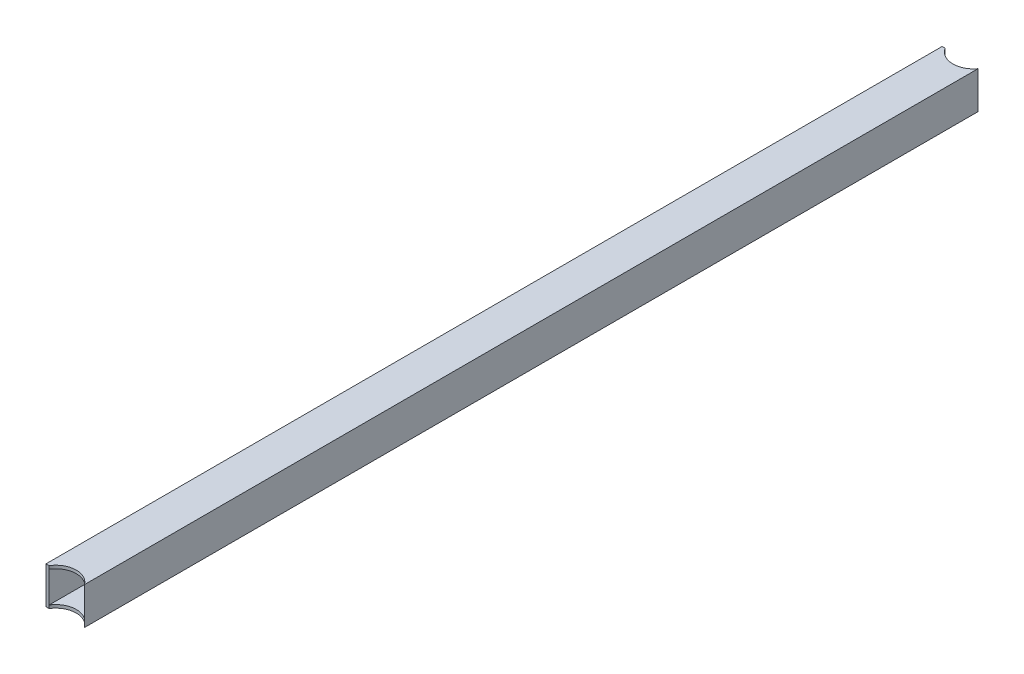
ISO-10303-21;
HEADER;
FILE_DESCRIPTION(('STEP AP214'),'2;1');
FILE_NAME('part.step','',(''),(''),'','','');
FILE_SCHEMA(('AUTOMOTIVE_DESIGN { 1 0 10303 214 1 1 1 1 }'));
ENDSEC;
DATA;
#1=APPLICATION_CONTEXT('core data for automotive mechanical design processes');
#2=APPLICATION_PROTOCOL_DEFINITION('international standard','automotive_design',2000,#1);
#3=PRODUCT_CONTEXT('',#1,'mechanical');
#4=PRODUCT('Part','Part','',(#3));
#5=PRODUCT_RELATED_PRODUCT_CATEGORY('part','',(#4));
#6=PRODUCT_DEFINITION_FORMATION('','',#4);
#7=PRODUCT_DEFINITION_CONTEXT('part definition',#1,'design');
#8=PRODUCT_DEFINITION('design','',#6,#7);
#9=PRODUCT_DEFINITION_SHAPE('','',#8);
#10=(LENGTH_UNIT() NAMED_UNIT(*) SI_UNIT(.MILLI.,.METRE.));
#11=(NAMED_UNIT(*) PLANE_ANGLE_UNIT() SI_UNIT($,.RADIAN.));
#12=(NAMED_UNIT(*) SI_UNIT($,.STERADIAN.) SOLID_ANGLE_UNIT());
#13=UNCERTAINTY_MEASURE_WITH_UNIT(LENGTH_MEASURE(1.E-05),#10,'distance_accuracy_value','');
#14=(GEOMETRIC_REPRESENTATION_CONTEXT(3) GLOBAL_UNCERTAINTY_ASSIGNED_CONTEXT((#13)) GLOBAL_UNIT_ASSIGNED_CONTEXT((#10,
#11,#12)) REPRESENTATION_CONTEXT('',''));
#15=CARTESIAN_POINT('',(0.,0.,0.));
#16=DIRECTION('',(0.,0.,1.));
#17=DIRECTION('',(1.,0.,0.));
#18=AXIS2_PLACEMENT_3D('',#15,#16,#17);
#19=CARTESIAN_POINT('',(21.0820000000001,0.,469.9));
#20=DIRECTION('',(0.,1.,0.));
#21=DIRECTION('',(0.,0.,1.));
#22=AXIS2_PLACEMENT_3D('',#19,#20,#21);
#23=CYLINDRICAL_SURFACE('',#22,21.082);
#24=DIRECTION('',(0.,1.,0.));
#25=VECTOR('',#24,1.);
#26=CARTESIAN_POINT('',(3.17500000000001,0.,458.773901177861));
#27=LINE('',#26,#25);
#28=CARTESIAN_POINT('',(3.17500000000001,3.175,458.773901177861));
#29=VERTEX_POINT('',#28);
#30=CARTESIAN_POINT('',(3.17500000000001,34.925,458.773901177861));
#31=VERTEX_POINT('',#30);
#32=EDGE_CURVE('E150',#29,#31,#27,.T.);
#33=ORIENTED_EDGE('',*,*,#32,.T.);
#34=CARTESIAN_POINT('',(21.0820000000001,34.925,469.9));
#35=DIRECTION('',(0.,-1.,0.));
#36=DIRECTION('',(0.,0.,-1.));
#37=AXIS2_PLACEMENT_3D('',#34,#35,#36);
#38=CIRCLE('',#37,21.082);
#39=CARTESIAN_POINT('',(34.925,34.925,453.999620287553));
#40=VERTEX_POINT('',#39);
#41=EDGE_CURVE('E11',#31,#40,#38,.T.);
#42=ORIENTED_EDGE('',*,*,#41,.T.);
#43=DIRECTION('',(0.,1.,0.));
#44=VECTOR('',#43,1.);
#45=CARTESIAN_POINT('',(34.925,0.,453.999620287553));
#46=LINE('',#45,#44);
#47=CARTESIAN_POINT('',(34.925,3.175,453.999620287553));
#48=VERTEX_POINT('',#47);
#49=EDGE_CURVE('E154',#40,#48,#46,.F.);
#50=ORIENTED_EDGE('',*,*,#49,.T.);
#51=CARTESIAN_POINT('',(21.0820000000001,3.175,469.9));
#52=DIRECTION('',(0.,1.,0.));
#53=DIRECTION('',(0.,0.,1.));
#54=AXIS2_PLACEMENT_3D('',#51,#52,#53);
#55=CIRCLE('',#54,21.082);
#56=EDGE_CURVE('E152',#48,#29,#55,.T.);
#57=ORIENTED_EDGE('',*,*,#56,.T.);
#58=EDGE_LOOP('',(#33,#42,#50,#57));
#59=FACE_BOUND('',#58,.T.);
#60=DIRECTION('',(0.,1.,0.));
#61=VECTOR('',#60,1.);
#62=CARTESIAN_POINT('',(3.16655784106913,0.,458.7875));
#63=LINE('',#62,#61);
#64=CARTESIAN_POINT('',(3.16655784106913,0.,458.7875));
#65=VERTEX_POINT('',#64);
#66=CARTESIAN_POINT('',(3.16655784106913,38.1,458.7875));
#67=VERTEX_POINT('',#66);
#68=EDGE_CURVE('E114',#65,#67,#63,.T.);
#69=ORIENTED_EDGE('',*,*,#68,.F.);
#70=CARTESIAN_POINT('',(21.0820000000001,0.,469.9));
#71=DIRECTION('',(0.,1.,0.));
#72=DIRECTION('',(0.,0.,1.));
#73=AXIS2_PLACEMENT_3D('',#70,#71,#72);
#74=CIRCLE('',#73,21.082);
#75=CARTESIAN_POINT('',(38.1,0.,457.456592106661));
#76=VERTEX_POINT('',#75);
#77=EDGE_CURVE('E122',#76,#65,#74,.T.);
#78=ORIENTED_EDGE('',*,*,#77,.F.);
#79=DIRECTION('',(0.,1.,0.));
#80=VECTOR('',#79,1.);
#81=CARTESIAN_POINT('',(38.1,0.,457.456592106661));
#82=LINE('',#81,#80);
#83=CARTESIAN_POINT('',(38.1,38.1,457.456592106661));
#84=VERTEX_POINT('',#83);
#85=EDGE_CURVE('E147',#84,#76,#82,.F.);
#86=ORIENTED_EDGE('',*,*,#85,.F.);
#87=CARTESIAN_POINT('',(21.0820000000001,38.1,469.9));
#88=DIRECTION('',(0.,1.,0.));
#89=DIRECTION('',(0.,0.,1.));
#90=AXIS2_PLACEMENT_3D('',#87,#88,#89);
#91=CIRCLE('',#90,21.082);
#92=EDGE_CURVE('E169',#84,#67,#91,.T.);
#93=ORIENTED_EDGE('',*,*,#92,.T.);
#94=EDGE_LOOP('',(#69,#78,#86,#93));
#95=FACE_BOUND('',#94,.T.);
#96=ADVANCED_FACE('F32',(#59,#95),#23,.F.);
#97=CARTESIAN_POINT('',(0.,38.1,1270.));
#98=DIRECTION('',(0.,-1.,0.));
#99=DIRECTION('',(0.,0.,-1.));
#100=AXIS2_PLACEMENT_3D('',#97,#98,#99);
#101=PLANE('',#100);
#102=DIRECTION('',(1.,0.,0.));
#103=VECTOR('',#102,1.);
#104=CARTESIAN_POINT('',(0.,38.1,458.7875));
#105=LINE('',#104,#103);
#106=CARTESIAN_POINT('',(0.,38.1,458.7875));
#107=VERTEX_POINT('',#106);
#108=EDGE_CURVE('E47',#107,#67,#105,.T.);
#109=ORIENTED_EDGE('',*,*,#108,.T.);
#110=ORIENTED_EDGE('',*,*,#92,.F.);
#111=DIRECTION('',(0.,0.,-1.));
#112=VECTOR('',#111,1.);
#113=CARTESIAN_POINT('',(38.1,38.1,1270.));
#114=LINE('',#113,#112);
#115=CARTESIAN_POINT('',(38.1,38.1,-457.456592106662));
#116=VERTEX_POINT('',#115);
#117=EDGE_CURVE('E128',#84,#116,#114,.T.);
#118=ORIENTED_EDGE('',*,*,#117,.T.);
#119=CARTESIAN_POINT('',(21.0819999999996,38.1,-469.9));
#120=DIRECTION('',(0.,1.,0.));
#121=DIRECTION('',(0.,0.,-1.));
#122=AXIS2_PLACEMENT_3D('',#119,#120,#121);
#123=CIRCLE('',#122,21.0819999999999);
#124=CARTESIAN_POINT('',(3.16655784106879,38.1,-458.7875));
#125=VERTEX_POINT('',#124);
#126=EDGE_CURVE('E165',#125,#116,#123,.T.);
#127=ORIENTED_EDGE('',*,*,#126,.F.);
#128=DIRECTION('',(1.,0.,0.));
#129=VECTOR('',#128,1.);
#130=CARTESIAN_POINT('',(0.,38.1,-458.7875));
#131=LINE('',#130,#129);
#132=CARTESIAN_POINT('',(0.,38.1,-458.7875));
#133=VERTEX_POINT('',#132);
#134=EDGE_CURVE('E177',#133,#125,#131,.T.);
#135=ORIENTED_EDGE('',*,*,#134,.F.);
#136=DIRECTION('',(0.,0.,-1.));
#137=VECTOR('',#136,1.);
#138=CARTESIAN_POINT('',(0.,38.1,1270.));
#139=LINE('',#138,#137);
#140=EDGE_CURVE('E133',#107,#133,#139,.T.);
#141=ORIENTED_EDGE('',*,*,#140,.F.);
#142=EDGE_LOOP('',(#109,#110,#118,#127,#135,#141));
#143=FACE_BOUND('',#142,.T.);
#144=ADVANCED_FACE('F183',(#143),#101,.F.);
#145=CARTESIAN_POINT('',(0.,0.,1270.));
#146=DIRECTION('',(0.,1.,0.));
#147=DIRECTION('',(0.,0.,1.));
#148=AXIS2_PLACEMENT_3D('',#145,#146,#147);
#149=PLANE('',#148);
#150=DIRECTION('',(1.,0.,0.));
#151=VECTOR('',#150,1.);
#152=CARTESIAN_POINT('',(0.,0.,458.7875));
#153=LINE('',#152,#151);
#154=CARTESIAN_POINT('',(0.,0.,458.7875));
#155=VERTEX_POINT('',#154);
#156=EDGE_CURVE('E108',#155,#65,#153,.T.);
#157=ORIENTED_EDGE('',*,*,#156,.F.);
#158=DIRECTION('',(0.,0.,-1.));
#159=VECTOR('',#158,1.);
#160=CARTESIAN_POINT('',(0.,0.,1270.));
#161=LINE('',#160,#159);
#162=CARTESIAN_POINT('',(0.,0.,-458.787499999999));
#163=VERTEX_POINT('',#162);
#164=EDGE_CURVE('E120',#155,#163,#161,.T.);
#165=ORIENTED_EDGE('',*,*,#164,.T.);
#166=DIRECTION('',(1.,0.,0.));
#167=VECTOR('',#166,1.);
#168=CARTESIAN_POINT('',(0.,0.,-458.7875));
#169=LINE('',#168,#167);
#170=CARTESIAN_POINT('',(3.16655784106879,0.,-458.7875));
#171=VERTEX_POINT('',#170);
#172=EDGE_CURVE('E55',#163,#171,#169,.T.);
#173=ORIENTED_EDGE('',*,*,#172,.T.);
#174=CARTESIAN_POINT('',(21.0819999999996,0.,-469.9));
#175=DIRECTION('',(0.,1.,0.));
#176=DIRECTION('',(0.,0.,-1.));
#177=AXIS2_PLACEMENT_3D('',#174,#175,#176);
#178=CIRCLE('',#177,21.0819999999999);
#179=CARTESIAN_POINT('',(38.1,0.,-457.456592106662));
#180=VERTEX_POINT('',#179);
#181=EDGE_CURVE('E167',#171,#180,#178,.T.);
#182=ORIENTED_EDGE('',*,*,#181,.T.);
#183=DIRECTION('',(0.,0.,-1.));
#184=VECTOR('',#183,1.);
#185=CARTESIAN_POINT('',(38.1,0.,1270.));
#186=LINE('',#185,#184);
#187=EDGE_CURVE('E125',#76,#180,#186,.T.);
#188=ORIENTED_EDGE('',*,*,#187,.F.);
#189=ORIENTED_EDGE('',*,*,#77,.T.);
#190=EDGE_LOOP('',(#157,#165,#173,#182,#188,#189));
#191=FACE_BOUND('',#190,.T.);
#192=ADVANCED_FACE('F119',(#191),#149,.F.);
#193=CARTESIAN_POINT('',(0.,0.,1270.));
#194=DIRECTION('',(1.,0.,0.));
#195=DIRECTION('',(0.,0.,-1.));
#196=AXIS2_PLACEMENT_3D('',#193,#194,#195);
#197=PLANE('',#196);
#198=DIRECTION('',(0.,1.,0.));
#199=VECTOR('',#198,1.);
#200=CARTESIAN_POINT('',(0.,0.,458.7875));
#201=LINE('',#200,#199);
#202=EDGE_CURVE('E105',#155,#107,#201,.T.);
#203=ORIENTED_EDGE('',*,*,#202,.T.);
#204=ORIENTED_EDGE('',*,*,#140,.T.);
#205=DIRECTION('',(0.,1.,0.));
#206=VECTOR('',#205,1.);
#207=CARTESIAN_POINT('',(0.,0.,-458.7875));
#208=LINE('',#207,#206);
#209=EDGE_CURVE('E124',#163,#133,#208,.T.);
#210=ORIENTED_EDGE('',*,*,#209,.F.);
#211=ORIENTED_EDGE('',*,*,#164,.F.);
#212=EDGE_LOOP('',(#203,#204,#210,#211));
#213=FACE_BOUND('',#212,.T.);
#214=ADVANCED_FACE('F34',(#213),#197,.F.);
#215=CARTESIAN_POINT('',(3.175,34.925,1270.));
#216=DIRECTION('',(0.,-1.,0.));
#217=DIRECTION('',(0.,0.,-1.));
#218=AXIS2_PLACEMENT_3D('',#215,#216,#217);
#219=PLANE('',#218);
#220=ORIENTED_EDGE('',*,*,#41,.F.);
#221=DIRECTION('',(0.,0.,-1.));
#222=VECTOR('',#221,1.);
#223=CARTESIAN_POINT('',(3.175,34.925,1270.));
#224=LINE('',#223,#222);
#225=CARTESIAN_POINT('',(3.17500000000001,34.925,-458.773901177861));
#226=VERTEX_POINT('',#225);
#227=EDGE_CURVE('E144',#31,#226,#224,.T.);
#228=ORIENTED_EDGE('',*,*,#227,.T.);
#229=CARTESIAN_POINT('',(21.0819999999996,34.925,-469.9));
#230=DIRECTION('',(0.,-1.,0.));
#231=DIRECTION('',(0.,0.,-1.));
#232=AXIS2_PLACEMENT_3D('',#229,#230,#231);
#233=CIRCLE('',#232,21.0819999999999);
#234=CARTESIAN_POINT('',(34.925,34.925,-453.999620287553));
#235=VERTEX_POINT('',#234);
#236=EDGE_CURVE('E40',#235,#226,#233,.T.);
#237=ORIENTED_EDGE('',*,*,#236,.F.);
#238=DIRECTION('',(0.,0.,-1.));
#239=VECTOR('',#238,1.);
#240=CARTESIAN_POINT('',(34.925,34.925,1270.));
#241=LINE('',#240,#239);
#242=EDGE_CURVE('E141',#40,#235,#241,.T.);
#243=ORIENTED_EDGE('',*,*,#242,.F.);
#244=EDGE_LOOP('',(#220,#228,#237,#243));
#245=FACE_BOUND('',#244,.T.);
#246=ADVANCED_FACE('F215',(#245),#219,.T.);
#247=CARTESIAN_POINT('',(34.925,3.175,1270.));
#248=DIRECTION('',(-1.,0.,0.));
#249=DIRECTION('',(0.,0.,1.));
#250=AXIS2_PLACEMENT_3D('',#247,#248,#249);
#251=PLANE('',#250);
#252=ORIENTED_EDGE('',*,*,#49,.F.);
#253=ORIENTED_EDGE('',*,*,#242,.T.);
#254=DIRECTION('',(0.,1.,0.));
#255=VECTOR('',#254,1.);
#256=CARTESIAN_POINT('',(34.925,0.,-453.999620287553));
#257=LINE('',#256,#255);
#258=CARTESIAN_POINT('',(34.925,3.175,-453.999620287553));
#259=VERTEX_POINT('',#258);
#260=EDGE_CURVE('E162',#259,#235,#257,.T.);
#261=ORIENTED_EDGE('',*,*,#260,.F.);
#262=DIRECTION('',(0.,0.,-1.));
#263=VECTOR('',#262,1.);
#264=CARTESIAN_POINT('',(34.925,3.175,1270.));
#265=LINE('',#264,#263);
#266=EDGE_CURVE('E138',#48,#259,#265,.T.);
#267=ORIENTED_EDGE('',*,*,#266,.F.);
#268=EDGE_LOOP('',(#252,#253,#261,#267));
#269=FACE_BOUND('',#268,.T.);
#270=ADVANCED_FACE('F218',(#269),#251,.T.);
#271=CARTESIAN_POINT('',(3.175,3.175,1270.));
#272=DIRECTION('',(0.,1.,0.));
#273=DIRECTION('',(0.,0.,1.));
#274=AXIS2_PLACEMENT_3D('',#271,#272,#273);
#275=PLANE('',#274);
#276=ORIENTED_EDGE('',*,*,#56,.F.);
#277=ORIENTED_EDGE('',*,*,#266,.T.);
#278=CARTESIAN_POINT('',(21.0819999999996,3.175,-469.9));
#279=DIRECTION('',(0.,1.,0.));
#280=DIRECTION('',(0.,0.,1.));
#281=AXIS2_PLACEMENT_3D('',#278,#279,#280);
#282=CIRCLE('',#281,21.0819999999999);
#283=CARTESIAN_POINT('',(3.17500000000001,3.175,-458.773901177861));
#284=VERTEX_POINT('',#283);
#285=EDGE_CURVE('E161',#284,#259,#282,.T.);
#286=ORIENTED_EDGE('',*,*,#285,.F.);
#287=DIRECTION('',(0.,0.,-1.));
#288=VECTOR('',#287,1.);
#289=CARTESIAN_POINT('',(3.175,3.175,1270.));
#290=LINE('',#289,#288);
#291=EDGE_CURVE('E135',#29,#284,#290,.T.);
#292=ORIENTED_EDGE('',*,*,#291,.F.);
#293=EDGE_LOOP('',(#276,#277,#286,#292));
#294=FACE_BOUND('',#293,.T.);
#295=ADVANCED_FACE('F222',(#294),#275,.T.);
#296=CARTESIAN_POINT('',(3.175,3.175,1270.));
#297=DIRECTION('',(1.,0.,0.));
#298=DIRECTION('',(0.,0.,-1.));
#299=AXIS2_PLACEMENT_3D('',#296,#297,#298);
#300=PLANE('',#299);
#301=ORIENTED_EDGE('',*,*,#32,.F.);
#302=ORIENTED_EDGE('',*,*,#291,.T.);
#303=DIRECTION('',(0.,1.,0.));
#304=VECTOR('',#303,1.);
#305=CARTESIAN_POINT('',(3.17500000000001,0.,-458.773901177861));
#306=LINE('',#305,#304);
#307=EDGE_CURVE('E159',#226,#284,#306,.F.);
#308=ORIENTED_EDGE('',*,*,#307,.F.);
#309=ORIENTED_EDGE('',*,*,#227,.F.);
#310=EDGE_LOOP('',(#301,#302,#308,#309));
#311=FACE_BOUND('',#310,.T.);
#312=ADVANCED_FACE('F214',(#311),#300,.T.);
#313=CARTESIAN_POINT('',(21.0819999999996,0.,-469.9));
#314=DIRECTION('',(0.,1.,0.));
#315=DIRECTION('',(0.,0.,1.));
#316=AXIS2_PLACEMENT_3D('',#313,#314,#315);
#317=CYLINDRICAL_SURFACE('',#316,21.0819999999999);
#318=ORIENTED_EDGE('',*,*,#181,.F.);
#319=DIRECTION('',(0.,1.,0.));
#320=VECTOR('',#319,1.);
#321=CARTESIAN_POINT('',(3.16655784106879,0.,-458.7875));
#322=LINE('',#321,#320);
#323=EDGE_CURVE('E174',#171,#125,#322,.T.);
#324=ORIENTED_EDGE('',*,*,#323,.T.);
#325=ORIENTED_EDGE('',*,*,#126,.T.);
#326=DIRECTION('',(0.,1.,0.));
#327=VECTOR('',#326,1.);
#328=CARTESIAN_POINT('',(38.1,0.,-457.456592106662));
#329=LINE('',#328,#327);
#330=EDGE_CURVE('E156',#180,#116,#329,.T.);
#331=ORIENTED_EDGE('',*,*,#330,.F.);
#332=EDGE_LOOP('',(#318,#324,#325,#331));
#333=FACE_BOUND('',#332,.T.);
#334=ORIENTED_EDGE('',*,*,#307,.T.);
#335=ORIENTED_EDGE('',*,*,#285,.T.);
#336=ORIENTED_EDGE('',*,*,#260,.T.);
#337=ORIENTED_EDGE('',*,*,#236,.T.);
#338=EDGE_LOOP('',(#334,#335,#336,#337));
#339=FACE_BOUND('',#338,.T.);
#340=ADVANCED_FACE('F192',(#333,#339),#317,.F.);
#341=CARTESIAN_POINT('',(38.1,0.,1270.));
#342=DIRECTION('',(-1.,0.,0.));
#343=DIRECTION('',(0.,0.,1.));
#344=AXIS2_PLACEMENT_3D('',#341,#342,#343);
#345=PLANE('',#344);
#346=ORIENTED_EDGE('',*,*,#117,.F.);
#347=ORIENTED_EDGE('',*,*,#85,.T.);
#348=ORIENTED_EDGE('',*,*,#187,.T.);
#349=ORIENTED_EDGE('',*,*,#330,.T.);
#350=EDGE_LOOP('',(#346,#347,#348,#349));
#351=FACE_BOUND('',#350,.T.);
#352=ADVANCED_FACE('F188',(#351),#345,.F.);
#353=CARTESIAN_POINT('',(0.,0.,-458.7875));
#354=DIRECTION('',(0.,0.,1.));
#355=DIRECTION('',(1.,0.,0.));
#356=AXIS2_PLACEMENT_3D('',#353,#354,#355);
#357=PLANE('',#356);
#358=ORIENTED_EDGE('',*,*,#134,.T.);
#359=ORIENTED_EDGE('',*,*,#323,.F.);
#360=ORIENTED_EDGE('',*,*,#172,.F.);
#361=ORIENTED_EDGE('',*,*,#209,.T.);
#362=EDGE_LOOP('',(#358,#359,#360,#361));
#363=FACE_BOUND('',#362,.T.);
#364=ADVANCED_FACE('F195',(#363),#357,.F.);
#365=CARTESIAN_POINT('',(0.,0.,458.7875));
#366=DIRECTION('',(0.,0.,1.));
#367=DIRECTION('',(1.,0.,0.));
#368=AXIS2_PLACEMENT_3D('',#365,#366,#367);
#369=PLANE('',#368);
#370=ORIENTED_EDGE('',*,*,#108,.F.);
#371=ORIENTED_EDGE('',*,*,#202,.F.);
#372=ORIENTED_EDGE('',*,*,#156,.T.);
#373=ORIENTED_EDGE('',*,*,#68,.T.);
#374=EDGE_LOOP('',(#370,#371,#372,#373));
#375=FACE_BOUND('',#374,.T.);
#376=ADVANCED_FACE('F107',(#375),#369,.T.);
#377=CLOSED_SHELL('',(#96,#144,#192,#214,#246,#270,#295,#312,#340,#352,#364,#376));
#378=MANIFOLD_SOLID_BREP('B2',#377);
#379=ADVANCED_BREP_SHAPE_REPRESENTATION('',(#18,#378),#14);
#380=SHAPE_DEFINITION_REPRESENTATION(#9,#379);
ENDSEC;
END-ISO-10303-21;
